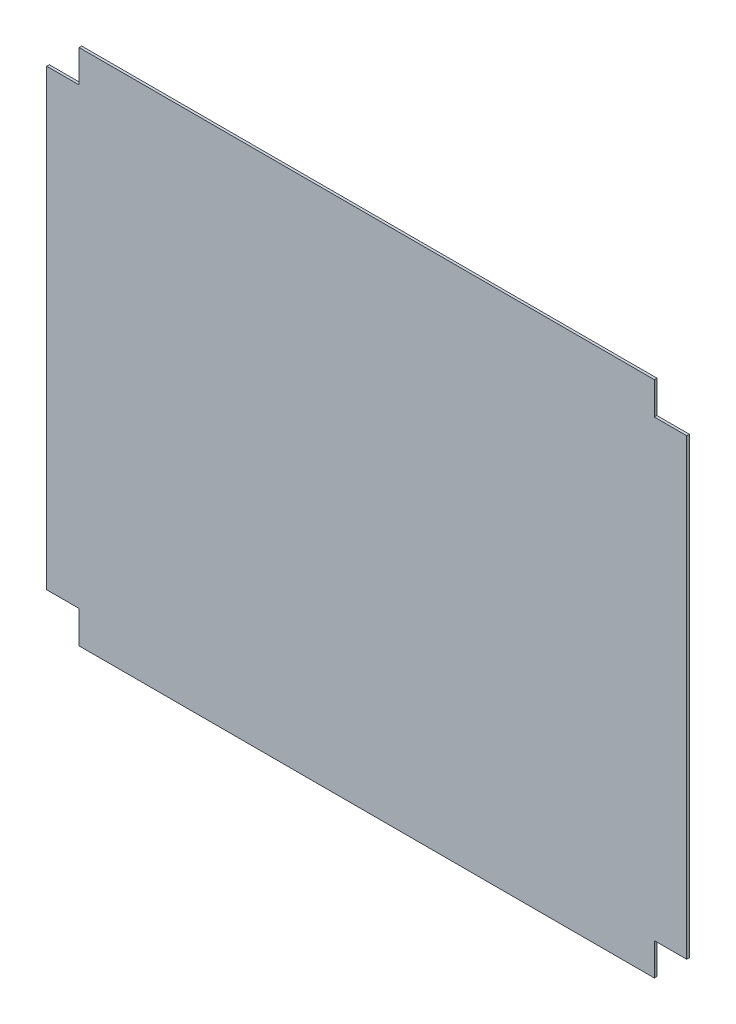
ISO-10303-21;
HEADER;
FILE_DESCRIPTION(('STEP AP214'),'2;1');
FILE_NAME('part.step','',(''),(''),'','','');
FILE_SCHEMA(('AUTOMOTIVE_DESIGN { 1 0 10303 214 1 1 1 1 }'));
ENDSEC;
DATA;
#1=APPLICATION_CONTEXT('core data for automotive mechanical design processes');
#2=APPLICATION_PROTOCOL_DEFINITION('international standard','automotive_design',2000,#1);
#3=PRODUCT_CONTEXT('',#1,'mechanical');
#4=PRODUCT('Part','Part','',(#3));
#5=PRODUCT_RELATED_PRODUCT_CATEGORY('part','',(#4));
#6=PRODUCT_DEFINITION_FORMATION('','',#4);
#7=PRODUCT_DEFINITION_CONTEXT('part definition',#1,'design');
#8=PRODUCT_DEFINITION('design','',#6,#7);
#9=PRODUCT_DEFINITION_SHAPE('','',#8);
#10=(LENGTH_UNIT() NAMED_UNIT(*) SI_UNIT(.MILLI.,.METRE.));
#11=(NAMED_UNIT(*) PLANE_ANGLE_UNIT() SI_UNIT($,.RADIAN.));
#12=(NAMED_UNIT(*) SI_UNIT($,.STERADIAN.) SOLID_ANGLE_UNIT());
#13=UNCERTAINTY_MEASURE_WITH_UNIT(LENGTH_MEASURE(1.E-05),#10,'distance_accuracy_value','');
#14=(GEOMETRIC_REPRESENTATION_CONTEXT(3) GLOBAL_UNCERTAINTY_ASSIGNED_CONTEXT((#13)) GLOBAL_UNIT_ASSIGNED_CONTEXT((#10,
#11,#12)) REPRESENTATION_CONTEXT('',''));
#15=CARTESIAN_POINT('',(0.,0.,0.));
#16=DIRECTION('',(0.,0.,1.));
#17=DIRECTION('',(1.,0.,0.));
#18=AXIS2_PLACEMENT_3D('',#15,#16,#17);
#19=CARTESIAN_POINT('',(-247.,400.,-2.));
#20=DIRECTION('',(-1.,0.,0.));
#21=DIRECTION('',(0.,-1.,0.));
#22=AXIS2_PLACEMENT_3D('',#19,#20,#21);
#23=PLANE('',#22);
#24=DIRECTION('',(0.,0.,1.));
#25=VECTOR('',#24,1.);
#26=CARTESIAN_POINT('',(-247.,25.,-10.));
#27=LINE('',#26,#25);
#28=CARTESIAN_POINT('',(-247.,25.,-2.));
#29=VERTEX_POINT('',#28);
#30=CARTESIAN_POINT('',(-247.,25.,0.));
#31=VERTEX_POINT('',#30);
#32=EDGE_CURVE('E158',#29,#31,#27,.T.);
#33=ORIENTED_EDGE('',*,*,#32,.T.);
#34=DIRECTION('',(0.,-1.,0.));
#35=VECTOR('',#34,1.);
#36=CARTESIAN_POINT('',(-247.,400.,0.));
#37=LINE('',#36,#35);
#38=CARTESIAN_POINT('',(-247.,375.,0.));
#39=VERTEX_POINT('',#38);
#40=EDGE_CURVE('E208',#39,#31,#37,.T.);
#41=ORIENTED_EDGE('',*,*,#40,.F.);
#42=DIRECTION('',(0.,0.,1.));
#43=VECTOR('',#42,1.);
#44=CARTESIAN_POINT('',(-247.,375.,-10.));
#45=LINE('',#44,#43);
#46=CARTESIAN_POINT('',(-247.,375.,-2.));
#47=VERTEX_POINT('',#46);
#48=EDGE_CURVE('E180',#47,#39,#45,.T.);
#49=ORIENTED_EDGE('',*,*,#48,.F.);
#50=DIRECTION('',(0.,-1.,0.));
#51=VECTOR('',#50,1.);
#52=CARTESIAN_POINT('',(-247.,400.,-2.));
#53=LINE('',#52,#51);
#54=EDGE_CURVE('E209',#47,#29,#53,.T.);
#55=ORIENTED_EDGE('',*,*,#54,.T.);
#56=EDGE_LOOP('',(#33,#41,#49,#55));
#57=FACE_BOUND('',#56,.T.);
#58=ADVANCED_FACE('F37',(#57),#23,.T.);
#59=CARTESIAN_POINT('',(-247.,400.,-2.));
#60=DIRECTION('',(0.,1.,0.));
#61=DIRECTION('',(-1.,0.,0.));
#62=AXIS2_PLACEMENT_3D('',#59,#60,#61);
#63=PLANE('',#62);
#64=DIRECTION('',(0.,0.,1.));
#65=VECTOR('',#64,1.);
#66=CARTESIAN_POINT('',(222.,400.,-10.));
#67=LINE('',#66,#65);
#68=CARTESIAN_POINT('',(222.,400.,-2.));
#69=VERTEX_POINT('',#68);
#70=CARTESIAN_POINT('',(222.,400.,0.));
#71=VERTEX_POINT('',#70);
#72=EDGE_CURVE('E53',#69,#71,#67,.T.);
#73=ORIENTED_EDGE('',*,*,#72,.F.);
#74=DIRECTION('',(-1.,0.,0.));
#75=VECTOR('',#74,1.);
#76=CARTESIAN_POINT('',(-247.,400.,-2.));
#77=LINE('',#76,#75);
#78=CARTESIAN_POINT('',(-222.,400.,-2.));
#79=VERTEX_POINT('',#78);
#80=EDGE_CURVE('E11',#69,#79,#77,.T.);
#81=ORIENTED_EDGE('',*,*,#80,.T.);
#82=DIRECTION('',(0.,0.,1.));
#83=VECTOR('',#82,1.);
#84=CARTESIAN_POINT('',(-222.,400.,-10.));
#85=LINE('',#84,#83);
#86=CARTESIAN_POINT('',(-222.,400.,0.));
#87=VERTEX_POINT('',#86);
#88=EDGE_CURVE('E181',#79,#87,#85,.T.);
#89=ORIENTED_EDGE('',*,*,#88,.T.);
#90=DIRECTION('',(-1.,0.,0.));
#91=VECTOR('',#90,1.);
#92=CARTESIAN_POINT('',(-247.,400.,0.));
#93=LINE('',#92,#91);
#94=EDGE_CURVE('E40',#71,#87,#93,.T.);
#95=ORIENTED_EDGE('',*,*,#94,.F.);
#96=EDGE_LOOP('',(#73,#81,#89,#95));
#97=FACE_BOUND('',#96,.T.);
#98=ADVANCED_FACE('F224',(#97),#63,.T.);
#99=CARTESIAN_POINT('',(247.,400.,-2.));
#100=DIRECTION('',(1.,0.,0.));
#101=DIRECTION('',(0.,1.,0.));
#102=AXIS2_PLACEMENT_3D('',#99,#100,#101);
#103=PLANE('',#102);
#104=DIRECTION('',(0.,0.,1.));
#105=VECTOR('',#104,1.);
#106=CARTESIAN_POINT('',(247.,25.,-10.));
#107=LINE('',#106,#105);
#108=CARTESIAN_POINT('',(247.,25.,-2.));
#109=VERTEX_POINT('',#108);
#110=CARTESIAN_POINT('',(247.,25.,0.));
#111=VERTEX_POINT('',#110);
#112=EDGE_CURVE('E61',#109,#111,#107,.T.);
#113=ORIENTED_EDGE('',*,*,#112,.F.);
#114=DIRECTION('',(0.,1.,0.));
#115=VECTOR('',#114,1.);
#116=CARTESIAN_POINT('',(247.,400.,-2.));
#117=LINE('',#116,#115);
#118=CARTESIAN_POINT('',(247.,375.,-2.));
#119=VERTEX_POINT('',#118);
#120=EDGE_CURVE('E45',#109,#119,#117,.T.);
#121=ORIENTED_EDGE('',*,*,#120,.T.);
#122=DIRECTION('',(0.,0.,1.));
#123=VECTOR('',#122,1.);
#124=CARTESIAN_POINT('',(247.,375.,-10.));
#125=LINE('',#124,#123);
#126=CARTESIAN_POINT('',(247.,375.,0.));
#127=VERTEX_POINT('',#126);
#128=EDGE_CURVE('E136',#119,#127,#125,.T.);
#129=ORIENTED_EDGE('',*,*,#128,.T.);
#130=DIRECTION('',(0.,1.,0.));
#131=VECTOR('',#130,1.);
#132=CARTESIAN_POINT('',(247.,400.,0.));
#133=LINE('',#132,#131);
#134=EDGE_CURVE('E149',#111,#127,#133,.T.);
#135=ORIENTED_EDGE('',*,*,#134,.F.);
#136=EDGE_LOOP('',(#113,#121,#129,#135));
#137=FACE_BOUND('',#136,.T.);
#138=ADVANCED_FACE('F255',(#137),#103,.T.);
#139=CARTESIAN_POINT('',(-247.,0.,-2.));
#140=DIRECTION('',(0.,-1.,0.));
#141=DIRECTION('',(1.,0.,0.));
#142=AXIS2_PLACEMENT_3D('',#139,#140,#141);
#143=PLANE('',#142);
#144=DIRECTION('',(0.,0.,1.));
#145=VECTOR('',#144,1.);
#146=CARTESIAN_POINT('',(-222.,0.,-10.));
#147=LINE('',#146,#145);
#148=CARTESIAN_POINT('',(-222.,0.,-2.));
#149=VERTEX_POINT('',#148);
#150=CARTESIAN_POINT('',(-222.,0.,0.));
#151=VERTEX_POINT('',#150);
#152=EDGE_CURVE('E170',#149,#151,#147,.T.);
#153=ORIENTED_EDGE('',*,*,#152,.F.);
#154=DIRECTION('',(1.,0.,0.));
#155=VECTOR('',#154,1.);
#156=CARTESIAN_POINT('',(-247.,0.,-2.));
#157=LINE('',#156,#155);
#158=CARTESIAN_POINT('',(222.,0.,-2.));
#159=VERTEX_POINT('',#158);
#160=EDGE_CURVE('E212',#149,#159,#157,.T.);
#161=ORIENTED_EDGE('',*,*,#160,.T.);
#162=DIRECTION('',(0.,0.,1.));
#163=VECTOR('',#162,1.);
#164=CARTESIAN_POINT('',(222.,0.,-10.));
#165=LINE('',#164,#163);
#166=CARTESIAN_POINT('',(222.,0.,0.));
#167=VERTEX_POINT('',#166);
#168=EDGE_CURVE('E143',#159,#167,#165,.T.);
#169=ORIENTED_EDGE('',*,*,#168,.T.);
#170=DIRECTION('',(1.,0.,0.));
#171=VECTOR('',#170,1.);
#172=CARTESIAN_POINT('',(-247.,0.,0.));
#173=LINE('',#172,#171);
#174=EDGE_CURVE('E219',#151,#167,#173,.T.);
#175=ORIENTED_EDGE('',*,*,#174,.F.);
#176=EDGE_LOOP('',(#153,#161,#169,#175));
#177=FACE_BOUND('',#176,.T.);
#178=ADVANCED_FACE('F247',(#177),#143,.T.);
#179=CARTESIAN_POINT('',(0.,0.,-2.));
#180=DIRECTION('',(0.,0.,1.));
#181=DIRECTION('',(1.,0.,0.));
#182=AXIS2_PLACEMENT_3D('',#179,#180,#181);
#183=PLANE('',#182);
#184=DIRECTION('',(0.,1.,0.));
#185=VECTOR('',#184,1.);
#186=CARTESIAN_POINT('',(-222.,0.,-2.));
#187=LINE('',#186,#185);
#188=CARTESIAN_POINT('',(-222.,25.,-2.));
#189=VERTEX_POINT('',#188);
#190=EDGE_CURVE('E202',#149,#189,#187,.T.);
#191=ORIENTED_EDGE('',*,*,#190,.T.);
#192=DIRECTION('',(-1.,0.,0.));
#193=VECTOR('',#192,1.);
#194=CARTESIAN_POINT('',(0.,25.,-2.));
#195=LINE('',#194,#193);
#196=EDGE_CURVE('E205',#189,#29,#195,.T.);
#197=ORIENTED_EDGE('',*,*,#196,.T.);
#198=ORIENTED_EDGE('',*,*,#54,.F.);
#199=DIRECTION('',(1.,0.,0.));
#200=VECTOR('',#199,1.);
#201=CARTESIAN_POINT('',(0.,375.,-2.));
#202=LINE('',#201,#200);
#203=CARTESIAN_POINT('',(-222.,375.,-2.));
#204=VERTEX_POINT('',#203);
#205=EDGE_CURVE('E184',#47,#204,#202,.T.);
#206=ORIENTED_EDGE('',*,*,#205,.T.);
#207=DIRECTION('',(0.,1.,0.));
#208=VECTOR('',#207,1.);
#209=CARTESIAN_POINT('',(-222.,0.,-2.));
#210=LINE('',#209,#208);
#211=EDGE_CURVE('E190',#204,#79,#210,.T.);
#212=ORIENTED_EDGE('',*,*,#211,.T.);
#213=ORIENTED_EDGE('',*,*,#80,.F.);
#214=DIRECTION('',(0.,-1.,0.));
#215=VECTOR('',#214,1.);
#216=CARTESIAN_POINT('',(222.,0.,-2.));
#217=LINE('',#216,#215);
#218=CARTESIAN_POINT('',(222.,375.,-2.));
#219=VERTEX_POINT('',#218);
#220=EDGE_CURVE('E193',#69,#219,#217,.T.);
#221=ORIENTED_EDGE('',*,*,#220,.T.);
#222=DIRECTION('',(1.,0.,0.));
#223=VECTOR('',#222,1.);
#224=CARTESIAN_POINT('',(0.,375.,-2.));
#225=LINE('',#224,#223);
#226=EDGE_CURVE('E134',#219,#119,#225,.T.);
#227=ORIENTED_EDGE('',*,*,#226,.T.);
#228=ORIENTED_EDGE('',*,*,#120,.F.);
#229=DIRECTION('',(-1.,0.,0.));
#230=VECTOR('',#229,1.);
#231=CARTESIAN_POINT('',(0.,25.,-2.));
#232=LINE('',#231,#230);
#233=CARTESIAN_POINT('',(222.,25.,-2.));
#234=VERTEX_POINT('',#233);
#235=EDGE_CURVE('E196',#109,#234,#232,.T.);
#236=ORIENTED_EDGE('',*,*,#235,.T.);
#237=DIRECTION('',(0.,-1.,0.));
#238=VECTOR('',#237,1.);
#239=CARTESIAN_POINT('',(222.,0.,-2.));
#240=LINE('',#239,#238);
#241=EDGE_CURVE('E199',#234,#159,#240,.T.);
#242=ORIENTED_EDGE('',*,*,#241,.T.);
#243=ORIENTED_EDGE('',*,*,#160,.F.);
#244=EDGE_LOOP('',(#191,#197,#198,#206,#212,#213,#221,#227,#228,#236,#242,#243));
#245=FACE_BOUND('',#244,.T.);
#246=ADVANCED_FACE('F230',(#245),#183,.F.);
#247=CARTESIAN_POINT('',(0.,0.,0.));
#248=DIRECTION('',(0.,0.,1.));
#249=DIRECTION('',(1.,0.,0.));
#250=AXIS2_PLACEMENT_3D('',#247,#248,#249);
#251=PLANE('',#250);
#252=DIRECTION('',(-1.,0.,0.));
#253=VECTOR('',#252,1.);
#254=CARTESIAN_POINT('',(-247.,25.,0.));
#255=LINE('',#254,#253);
#256=CARTESIAN_POINT('',(-222.,25.,0.));
#257=VERTEX_POINT('',#256);
#258=EDGE_CURVE('E168',#257,#31,#255,.T.);
#259=ORIENTED_EDGE('',*,*,#258,.F.);
#260=DIRECTION('',(0.,1.,0.));
#261=VECTOR('',#260,1.);
#262=CARTESIAN_POINT('',(-222.,0.,0.));
#263=LINE('',#262,#261);
#264=EDGE_CURVE('E165',#151,#257,#263,.T.);
#265=ORIENTED_EDGE('',*,*,#264,.F.);
#266=ORIENTED_EDGE('',*,*,#174,.T.);
#267=DIRECTION('',(0.,-1.,0.));
#268=VECTOR('',#267,1.);
#269=CARTESIAN_POINT('',(222.,0.,0.));
#270=LINE('',#269,#268);
#271=CARTESIAN_POINT('',(222.,25.,0.));
#272=VERTEX_POINT('',#271);
#273=EDGE_CURVE('E157',#272,#167,#270,.T.);
#274=ORIENTED_EDGE('',*,*,#273,.F.);
#275=DIRECTION('',(-1.,0.,0.));
#276=VECTOR('',#275,1.);
#277=CARTESIAN_POINT('',(247.,25.,0.));
#278=LINE('',#277,#276);
#279=EDGE_CURVE('E155',#111,#272,#278,.T.);
#280=ORIENTED_EDGE('',*,*,#279,.F.);
#281=ORIENTED_EDGE('',*,*,#134,.T.);
#282=DIRECTION('',(1.,0.,0.));
#283=VECTOR('',#282,1.);
#284=CARTESIAN_POINT('',(247.,375.,0.));
#285=LINE('',#284,#283);
#286=CARTESIAN_POINT('',(222.,375.,0.));
#287=VERTEX_POINT('',#286);
#288=EDGE_CURVE('E131',#287,#127,#285,.T.);
#289=ORIENTED_EDGE('',*,*,#288,.F.);
#290=DIRECTION('',(0.,-1.,0.));
#291=VECTOR('',#290,1.);
#292=CARTESIAN_POINT('',(222.,400.,0.));
#293=LINE('',#292,#291);
#294=EDGE_CURVE('E138',#71,#287,#293,.T.);
#295=ORIENTED_EDGE('',*,*,#294,.F.);
#296=ORIENTED_EDGE('',*,*,#94,.T.);
#297=DIRECTION('',(0.,1.,0.));
#298=VECTOR('',#297,1.);
#299=CARTESIAN_POINT('',(-222.,400.,0.));
#300=LINE('',#299,#298);
#301=CARTESIAN_POINT('',(-222.,375.,0.));
#302=VERTEX_POINT('',#301);
#303=EDGE_CURVE('E178',#302,#87,#300,.T.);
#304=ORIENTED_EDGE('',*,*,#303,.F.);
#305=DIRECTION('',(1.,0.,0.));
#306=VECTOR('',#305,1.);
#307=CARTESIAN_POINT('',(-247.,375.,0.));
#308=LINE('',#307,#306);
#309=EDGE_CURVE('E153',#39,#302,#308,.T.);
#310=ORIENTED_EDGE('',*,*,#309,.F.);
#311=ORIENTED_EDGE('',*,*,#40,.T.);
#312=EDGE_LOOP('',(#259,#265,#266,#274,#280,#281,#289,#295,#296,#304,#310,#311));
#313=FACE_BOUND('',#312,.T.);
#314=ADVANCED_FACE('F147',(#313),#251,.T.);
#315=CARTESIAN_POINT('',(-222.,400.,-10.));
#316=DIRECTION('',(1.,0.,0.));
#317=DIRECTION('',(0.,0.,-1.));
#318=AXIS2_PLACEMENT_3D('',#315,#316,#317);
#319=PLANE('',#318);
#320=DIRECTION('',(0.,0.,1.));
#321=VECTOR('',#320,1.);
#322=CARTESIAN_POINT('',(-222.,375.,-10.));
#323=LINE('',#322,#321);
#324=EDGE_CURVE('E185',#204,#302,#323,.T.);
#325=ORIENTED_EDGE('',*,*,#324,.T.);
#326=ORIENTED_EDGE('',*,*,#303,.T.);
#327=ORIENTED_EDGE('',*,*,#88,.F.);
#328=ORIENTED_EDGE('',*,*,#211,.F.);
#329=EDGE_LOOP('',(#325,#326,#327,#328));
#330=FACE_BOUND('',#329,.T.);
#331=ADVANCED_FACE('F227',(#330),#319,.F.);
#332=CARTESIAN_POINT('',(-247.,375.,-10.));
#333=DIRECTION('',(0.,-1.,0.));
#334=DIRECTION('',(0.,0.,-1.));
#335=AXIS2_PLACEMENT_3D('',#332,#333,#334);
#336=PLANE('',#335);
#337=ORIENTED_EDGE('',*,*,#48,.T.);
#338=ORIENTED_EDGE('',*,*,#309,.T.);
#339=ORIENTED_EDGE('',*,*,#324,.F.);
#340=ORIENTED_EDGE('',*,*,#205,.F.);
#341=EDGE_LOOP('',(#337,#338,#339,#340));
#342=FACE_BOUND('',#341,.T.);
#343=ADVANCED_FACE('F234',(#342),#336,.F.);
#344=CARTESIAN_POINT('',(247.,375.,-10.));
#345=DIRECTION('',(0.,-1.,0.));
#346=DIRECTION('',(0.,0.,-1.));
#347=AXIS2_PLACEMENT_3D('',#344,#345,#346);
#348=PLANE('',#347);
#349=DIRECTION('',(0.,0.,1.));
#350=VECTOR('',#349,1.);
#351=CARTESIAN_POINT('',(222.,375.,-10.));
#352=LINE('',#351,#350);
#353=EDGE_CURVE('E128',#219,#287,#352,.T.);
#354=ORIENTED_EDGE('',*,*,#353,.T.);
#355=ORIENTED_EDGE('',*,*,#288,.T.);
#356=ORIENTED_EDGE('',*,*,#128,.F.);
#357=ORIENTED_EDGE('',*,*,#226,.F.);
#358=EDGE_LOOP('',(#354,#355,#356,#357));
#359=FACE_BOUND('',#358,.T.);
#360=ADVANCED_FACE('F129',(#359),#348,.F.);
#361=CARTESIAN_POINT('',(222.,400.,-10.));
#362=DIRECTION('',(-1.,0.,0.));
#363=DIRECTION('',(0.,0.,1.));
#364=AXIS2_PLACEMENT_3D('',#361,#362,#363);
#365=PLANE('',#364);
#366=ORIENTED_EDGE('',*,*,#72,.T.);
#367=ORIENTED_EDGE('',*,*,#294,.T.);
#368=ORIENTED_EDGE('',*,*,#353,.F.);
#369=ORIENTED_EDGE('',*,*,#220,.F.);
#370=EDGE_LOOP('',(#366,#367,#368,#369));
#371=FACE_BOUND('',#370,.T.);
#372=ADVANCED_FACE('F139',(#371),#365,.F.);
#373=CARTESIAN_POINT('',(222.,0.,-10.));
#374=DIRECTION('',(-1.,0.,0.));
#375=DIRECTION('',(0.,0.,1.));
#376=AXIS2_PLACEMENT_3D('',#373,#374,#375);
#377=PLANE('',#376);
#378=DIRECTION('',(0.,0.,1.));
#379=VECTOR('',#378,1.);
#380=CARTESIAN_POINT('',(222.,25.,-10.));
#381=LINE('',#380,#379);
#382=EDGE_CURVE('E162',#234,#272,#381,.T.);
#383=ORIENTED_EDGE('',*,*,#382,.T.);
#384=ORIENTED_EDGE('',*,*,#273,.T.);
#385=ORIENTED_EDGE('',*,*,#168,.F.);
#386=ORIENTED_EDGE('',*,*,#241,.F.);
#387=EDGE_LOOP('',(#383,#384,#385,#386));
#388=FACE_BOUND('',#387,.T.);
#389=ADVANCED_FACE('F251',(#388),#377,.F.);
#390=CARTESIAN_POINT('',(247.,25.,-10.));
#391=DIRECTION('',(0.,1.,0.));
#392=DIRECTION('',(0.,0.,1.));
#393=AXIS2_PLACEMENT_3D('',#390,#391,#392);
#394=PLANE('',#393);
#395=ORIENTED_EDGE('',*,*,#112,.T.);
#396=ORIENTED_EDGE('',*,*,#279,.T.);
#397=ORIENTED_EDGE('',*,*,#382,.F.);
#398=ORIENTED_EDGE('',*,*,#235,.F.);
#399=EDGE_LOOP('',(#395,#396,#397,#398));
#400=FACE_BOUND('',#399,.T.);
#401=ADVANCED_FACE('F252',(#400),#394,.F.);
#402=CARTESIAN_POINT('',(-247.,25.,-10.));
#403=DIRECTION('',(0.,1.,0.));
#404=DIRECTION('',(0.,0.,1.));
#405=AXIS2_PLACEMENT_3D('',#402,#403,#404);
#406=PLANE('',#405);
#407=DIRECTION('',(0.,0.,1.));
#408=VECTOR('',#407,1.);
#409=CARTESIAN_POINT('',(-222.,25.,-10.));
#410=LINE('',#409,#408);
#411=EDGE_CURVE('E173',#189,#257,#410,.T.);
#412=ORIENTED_EDGE('',*,*,#411,.T.);
#413=ORIENTED_EDGE('',*,*,#258,.T.);
#414=ORIENTED_EDGE('',*,*,#32,.F.);
#415=ORIENTED_EDGE('',*,*,#196,.F.);
#416=EDGE_LOOP('',(#412,#413,#414,#415));
#417=FACE_BOUND('',#416,.T.);
#418=ADVANCED_FACE('F240',(#417),#406,.F.);
#419=CARTESIAN_POINT('',(-222.,0.,-10.));
#420=DIRECTION('',(1.,0.,0.));
#421=DIRECTION('',(0.,0.,-1.));
#422=AXIS2_PLACEMENT_3D('',#419,#420,#421);
#423=PLANE('',#422);
#424=ORIENTED_EDGE('',*,*,#152,.T.);
#425=ORIENTED_EDGE('',*,*,#264,.T.);
#426=ORIENTED_EDGE('',*,*,#411,.F.);
#427=ORIENTED_EDGE('',*,*,#190,.F.);
#428=EDGE_LOOP('',(#424,#425,#426,#427));
#429=FACE_BOUND('',#428,.T.);
#430=ADVANCED_FACE('F243',(#429),#423,.F.);
#431=CLOSED_SHELL('',(#58,#98,#138,#178,#246,#314,#331,#343,#360,#372,#389,#401,#418,#430));
#432=MANIFOLD_SOLID_BREP('B2',#431);
#433=ADVANCED_BREP_SHAPE_REPRESENTATION('',(#18,#432),#14);
#434=SHAPE_DEFINITION_REPRESENTATION(#9,#433);
ENDSEC;
END-ISO-10303-21;
